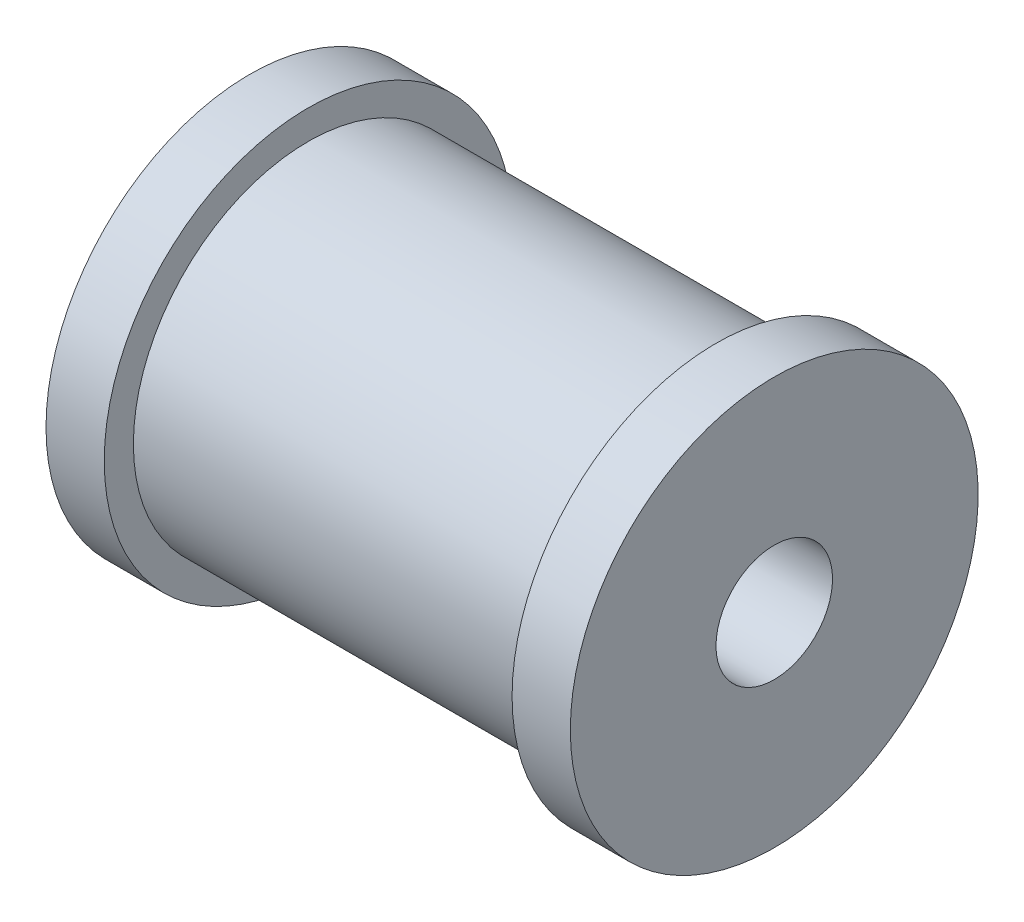
ISO-10303-21;
HEADER;
FILE_DESCRIPTION(('STEP AP214'),'2;1');
FILE_NAME('part.step','',(''),(''),'','','');
FILE_SCHEMA(('AUTOMOTIVE_DESIGN { 1 0 10303 214 1 1 1 1 }'));
ENDSEC;
DATA;
#1=APPLICATION_CONTEXT('core data for automotive mechanical design processes');
#2=APPLICATION_PROTOCOL_DEFINITION('international standard','automotive_design',2000,#1);
#3=PRODUCT_CONTEXT('',#1,'mechanical');
#4=PRODUCT('Part','Part','',(#3));
#5=PRODUCT_RELATED_PRODUCT_CATEGORY('part','',(#4));
#6=PRODUCT_DEFINITION_FORMATION('','',#4);
#7=PRODUCT_DEFINITION_CONTEXT('part definition',#1,'design');
#8=PRODUCT_DEFINITION('design','',#6,#7);
#9=PRODUCT_DEFINITION_SHAPE('','',#8);
#10=(LENGTH_UNIT() NAMED_UNIT(*) SI_UNIT(.MILLI.,.METRE.));
#11=(NAMED_UNIT(*) PLANE_ANGLE_UNIT() SI_UNIT($,.RADIAN.));
#12=(NAMED_UNIT(*) SI_UNIT($,.STERADIAN.) SOLID_ANGLE_UNIT());
#13=UNCERTAINTY_MEASURE_WITH_UNIT(LENGTH_MEASURE(1.E-05),#10,'distance_accuracy_value','');
#14=(GEOMETRIC_REPRESENTATION_CONTEXT(3) GLOBAL_UNCERTAINTY_ASSIGNED_CONTEXT((#13)) GLOBAL_UNIT_ASSIGNED_CONTEXT((#10,
#11,#12)) REPRESENTATION_CONTEXT('',''));
#15=CARTESIAN_POINT('',(0.,0.,0.));
#16=DIRECTION('',(0.,0.,1.));
#17=DIRECTION('',(1.,0.,0.));
#18=AXIS2_PLACEMENT_3D('',#15,#16,#17);
#19=CARTESIAN_POINT('',(0.,0.,0.));
#20=DIRECTION('',(-1.,0.,0.));
#21=DIRECTION('',(0.,0.,1.));
#22=AXIS2_PLACEMENT_3D('',#19,#20,#21);
#23=CYLINDRICAL_SURFACE('',#22,2.);
#24=CARTESIAN_POINT('',(18.,0.,0.));
#25=DIRECTION('',(-1.,0.,0.));
#26=DIRECTION('',(0.,0.,1.));
#27=AXIS2_PLACEMENT_3D('',#24,#25,#26);
#28=CIRCLE('',#27,2.);
#29=CARTESIAN_POINT('',(18.,0.,2.));
#30=VERTEX_POINT('',#29);
#31=EDGE_CURVE('E10',#30,#30,#28,.T.);
#32=ORIENTED_EDGE('',*,*,#31,.F.);
#33=EDGE_LOOP('',(#32));
#34=FACE_BOUND('',#33,.T.);
#35=CARTESIAN_POINT('',(0.,0.,0.));
#36=DIRECTION('',(-1.,0.,0.));
#37=DIRECTION('',(0.,0.,1.));
#38=AXIS2_PLACEMENT_3D('',#35,#36,#37);
#39=CIRCLE('',#38,2.);
#40=CARTESIAN_POINT('',(0.,0.,2.));
#41=VERTEX_POINT('',#40);
#42=EDGE_CURVE('E71',#41,#41,#39,.T.);
#43=ORIENTED_EDGE('',*,*,#42,.T.);
#44=EDGE_LOOP('',(#43));
#45=FACE_BOUND('',#44,.T.);
#46=ADVANCED_FACE('F34',(#34,#45),#23,.F.);
#47=CARTESIAN_POINT('',(18.,2.,0.));
#48=DIRECTION('',(-1.,0.,0.));
#49=DIRECTION('',(0.,0.,1.));
#50=AXIS2_PLACEMENT_3D('',#47,#48,#49);
#51=PLANE('',#50);
#52=CARTESIAN_POINT('',(18.,0.,0.));
#53=DIRECTION('',(-1.,0.,0.));
#54=DIRECTION('',(0.,0.,1.));
#55=AXIS2_PLACEMENT_3D('',#52,#53,#54);
#56=CIRCLE('',#55,7.);
#57=CARTESIAN_POINT('',(18.,0.,7.00000000000001));
#58=VERTEX_POINT('',#57);
#59=EDGE_CURVE('E41',#58,#58,#56,.T.);
#60=ORIENTED_EDGE('',*,*,#59,.F.);
#61=EDGE_LOOP('',(#60));
#62=FACE_BOUND('',#61,.T.);
#63=ORIENTED_EDGE('',*,*,#31,.T.);
#64=EDGE_LOOP('',(#63));
#65=FACE_BOUND('',#64,.T.);
#66=ADVANCED_FACE('F110',(#62,#65),#51,.F.);
#67=CARTESIAN_POINT('',(0.,0.,0.));
#68=DIRECTION('',(-1.,0.,0.));
#69=DIRECTION('',(0.,0.,1.));
#70=AXIS2_PLACEMENT_3D('',#67,#68,#69);
#71=CYLINDRICAL_SURFACE('',#70,7.);
#72=CARTESIAN_POINT('',(16.,0.,0.));
#73=DIRECTION('',(-1.,0.,0.));
#74=DIRECTION('',(0.,0.,1.));
#75=AXIS2_PLACEMENT_3D('',#72,#73,#74);
#76=CIRCLE('',#75,7.);
#77=CARTESIAN_POINT('',(16.,0.,7.00000000000001));
#78=VERTEX_POINT('',#77);
#79=EDGE_CURVE('E47',#78,#78,#76,.T.);
#80=ORIENTED_EDGE('',*,*,#79,.F.);
#81=EDGE_LOOP('',(#80));
#82=FACE_BOUND('',#81,.T.);
#83=ORIENTED_EDGE('',*,*,#59,.T.);
#84=EDGE_LOOP('',(#83));
#85=FACE_BOUND('',#84,.T.);
#86=ADVANCED_FACE('F105',(#82,#85),#71,.T.);
#87=CARTESIAN_POINT('',(16.,6.00000000000001,0.));
#88=DIRECTION('',(1.,0.,0.));
#89=DIRECTION('',(0.,0.,-1.));
#90=AXIS2_PLACEMENT_3D('',#87,#88,#89);
#91=PLANE('',#90);
#92=CARTESIAN_POINT('',(16.,0.,0.));
#93=DIRECTION('',(-1.,0.,0.));
#94=DIRECTION('',(0.,0.,1.));
#95=AXIS2_PLACEMENT_3D('',#92,#93,#94);
#96=CIRCLE('',#95,6.);
#97=CARTESIAN_POINT('',(16.,0.,6.00000000000001));
#98=VERTEX_POINT('',#97);
#99=EDGE_CURVE('E53',#98,#98,#96,.T.);
#100=ORIENTED_EDGE('',*,*,#99,.F.);
#101=EDGE_LOOP('',(#100));
#102=FACE_BOUND('',#101,.T.);
#103=ORIENTED_EDGE('',*,*,#79,.T.);
#104=EDGE_LOOP('',(#103));
#105=FACE_BOUND('',#104,.T.);
#106=ADVANCED_FACE('F99',(#102,#105),#91,.F.);
#107=CARTESIAN_POINT('',(0.,0.,0.));
#108=DIRECTION('',(-1.,0.,0.));
#109=DIRECTION('',(0.,0.,1.));
#110=AXIS2_PLACEMENT_3D('',#107,#108,#109);
#111=CYLINDRICAL_SURFACE('',#110,6.);
#112=CARTESIAN_POINT('',(2.,0.,0.));
#113=DIRECTION('',(-1.,0.,0.));
#114=DIRECTION('',(0.,0.,1.));
#115=AXIS2_PLACEMENT_3D('',#112,#113,#114);
#116=CIRCLE('',#115,6.);
#117=CARTESIAN_POINT('',(2.,0.,6.00000000000001));
#118=VERTEX_POINT('',#117);
#119=EDGE_CURVE('E59',#118,#118,#116,.T.);
#120=ORIENTED_EDGE('',*,*,#119,.F.);
#121=EDGE_LOOP('',(#120));
#122=FACE_BOUND('',#121,.T.);
#123=ORIENTED_EDGE('',*,*,#99,.T.);
#124=EDGE_LOOP('',(#123));
#125=FACE_BOUND('',#124,.T.);
#126=ADVANCED_FACE('F93',(#122,#125),#111,.T.);
#127=CARTESIAN_POINT('',(2.,7.00000000000002,0.));
#128=DIRECTION('',(-1.,0.,0.));
#129=DIRECTION('',(0.,0.,1.));
#130=AXIS2_PLACEMENT_3D('',#127,#128,#129);
#131=PLANE('',#130);
#132=CARTESIAN_POINT('',(2.,0.,0.));
#133=DIRECTION('',(-1.,0.,0.));
#134=DIRECTION('',(0.,0.,1.));
#135=AXIS2_PLACEMENT_3D('',#132,#133,#134);
#136=CIRCLE('',#135,7.);
#137=CARTESIAN_POINT('',(2.,0.,7.00000000000001));
#138=VERTEX_POINT('',#137);
#139=EDGE_CURVE('E63',#138,#138,#136,.T.);
#140=ORIENTED_EDGE('',*,*,#139,.F.);
#141=EDGE_LOOP('',(#140));
#142=FACE_BOUND('',#141,.T.);
#143=ORIENTED_EDGE('',*,*,#119,.T.);
#144=EDGE_LOOP('',(#143));
#145=FACE_BOUND('',#144,.T.);
#146=ADVANCED_FACE('F87',(#142,#145),#131,.F.);
#147=CARTESIAN_POINT('',(0.,0.,0.));
#148=DIRECTION('',(-1.,0.,0.));
#149=DIRECTION('',(0.,0.,1.));
#150=AXIS2_PLACEMENT_3D('',#147,#148,#149);
#151=CYLINDRICAL_SURFACE('',#150,7.);
#152=CARTESIAN_POINT('',(0.,0.,0.));
#153=DIRECTION('',(-1.,0.,0.));
#154=DIRECTION('',(0.,0.,1.));
#155=AXIS2_PLACEMENT_3D('',#152,#153,#154);
#156=CIRCLE('',#155,7.);
#157=CARTESIAN_POINT('',(0.,0.,7.00000000000001));
#158=VERTEX_POINT('',#157);
#159=EDGE_CURVE('E67',#158,#158,#156,.T.);
#160=ORIENTED_EDGE('',*,*,#159,.F.);
#161=EDGE_LOOP('',(#160));
#162=FACE_BOUND('',#161,.T.);
#163=ORIENTED_EDGE('',*,*,#139,.T.);
#164=EDGE_LOOP('',(#163));
#165=FACE_BOUND('',#164,.T.);
#166=ADVANCED_FACE('F81',(#162,#165),#151,.T.);
#167=CARTESIAN_POINT('',(0.,2.,0.));
#168=DIRECTION('',(1.,0.,0.));
#169=DIRECTION('',(0.,0.,-1.));
#170=AXIS2_PLACEMENT_3D('',#167,#168,#169);
#171=PLANE('',#170);
#172=ORIENTED_EDGE('',*,*,#42,.F.);
#173=EDGE_LOOP('',(#172));
#174=FACE_BOUND('',#173,.T.);
#175=ORIENTED_EDGE('',*,*,#159,.T.);
#176=EDGE_LOOP('',(#175));
#177=FACE_BOUND('',#176,.T.);
#178=ADVANCED_FACE('F78',(#174,#177),#171,.F.);
#179=CLOSED_SHELL('',(#46,#66,#86,#106,#126,#146,#166,#178));
#180=MANIFOLD_SOLID_BREP('B2',#179);
#181=ADVANCED_BREP_SHAPE_REPRESENTATION('',(#18,#180),#14);
#182=SHAPE_DEFINITION_REPRESENTATION(#9,#181);
ENDSEC;
END-ISO-10303-21;
